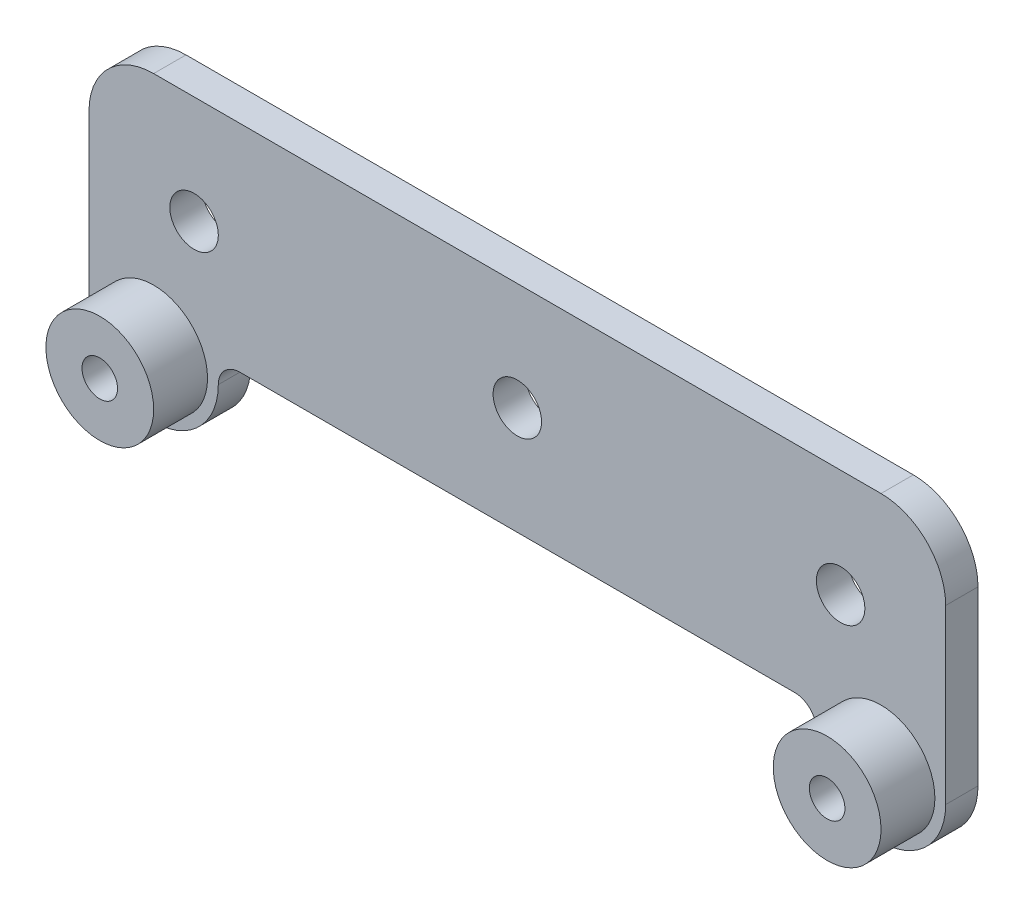
ISO-10303-21;
HEADER;
FILE_DESCRIPTION(('STEP AP214'),'2;1');
FILE_NAME('part.step','',(''),(''),'','','');
FILE_SCHEMA(('AUTOMOTIVE_DESIGN { 1 0 10303 214 1 1 1 1 }'));
ENDSEC;
DATA;
#1=APPLICATION_CONTEXT('core data for automotive mechanical design processes');
#2=APPLICATION_PROTOCOL_DEFINITION('international standard','automotive_design',2000,#1);
#3=PRODUCT_CONTEXT('',#1,'mechanical');
#4=PRODUCT('Part','Part','',(#3));
#5=PRODUCT_RELATED_PRODUCT_CATEGORY('part','',(#4));
#6=PRODUCT_DEFINITION_FORMATION('','',#4);
#7=PRODUCT_DEFINITION_CONTEXT('part definition',#1,'design');
#8=PRODUCT_DEFINITION('design','',#6,#7);
#9=PRODUCT_DEFINITION_SHAPE('','',#8);
#10=(LENGTH_UNIT() NAMED_UNIT(*) SI_UNIT(.MILLI.,.METRE.));
#11=(NAMED_UNIT(*) PLANE_ANGLE_UNIT() SI_UNIT($,.RADIAN.));
#12=(NAMED_UNIT(*) SI_UNIT($,.STERADIAN.) SOLID_ANGLE_UNIT());
#13=UNCERTAINTY_MEASURE_WITH_UNIT(LENGTH_MEASURE(1.E-05),#10,'distance_accuracy_value','');
#14=(GEOMETRIC_REPRESENTATION_CONTEXT(3) GLOBAL_UNCERTAINTY_ASSIGNED_CONTEXT((#13)) GLOBAL_UNIT_ASSIGNED_CONTEXT((#10,
#11,#12)) REPRESENTATION_CONTEXT('',''));
#15=CARTESIAN_POINT('',(0.,0.,0.));
#16=DIRECTION('',(0.,0.,1.));
#17=DIRECTION('',(1.,0.,0.));
#18=AXIS2_PLACEMENT_3D('',#15,#16,#17);
#19=CARTESIAN_POINT('',(-25.75,-12.,3.));
#20=DIRECTION('',(0.,0.,-1.));
#21=DIRECTION('',(-1.,0.,0.));
#22=AXIS2_PLACEMENT_3D('',#19,#20,#21);
#23=CYLINDRICAL_SURFACE('',#22,1.99999999999997);
#24=CARTESIAN_POINT('',(-25.75,-12.,0.));
#25=DIRECTION('',(0.,0.,-1.));
#26=DIRECTION('',(1.,0.,0.));
#27=AXIS2_PLACEMENT_3D('',#24,#25,#26);
#28=CIRCLE('',#27,1.99999999999997);
#29=CARTESIAN_POINT('',(-27.75,-12.,0.));
#30=VERTEX_POINT('',#29);
#31=CARTESIAN_POINT('',(-25.75,-10.,0.));
#32=VERTEX_POINT('',#31);
#33=EDGE_CURVE('E140',#30,#32,#28,.T.);
#34=ORIENTED_EDGE('',*,*,#33,.T.);
#35=DIRECTION('',(0.,0.,-1.));
#36=VECTOR('',#35,1.);
#37=CARTESIAN_POINT('',(-25.75,-10.,3.));
#38=LINE('',#37,#36);
#39=CARTESIAN_POINT('',(-25.75,-10.,3.));
#40=VERTEX_POINT('',#39);
#41=EDGE_CURVE('E11',#40,#32,#38,.T.);
#42=ORIENTED_EDGE('',*,*,#41,.F.);
#43=CARTESIAN_POINT('',(-25.75,-12.,3.));
#44=DIRECTION('',(0.,0.,-1.));
#45=DIRECTION('',(1.,0.,0.));
#46=AXIS2_PLACEMENT_3D('',#43,#44,#45);
#47=CIRCLE('',#46,1.99999999999997);
#48=CARTESIAN_POINT('',(-27.75,-12.,3.));
#49=VERTEX_POINT('',#48);
#50=EDGE_CURVE('E159',#49,#40,#47,.T.);
#51=ORIENTED_EDGE('',*,*,#50,.F.);
#52=DIRECTION('',(0.,0.,-1.));
#53=VECTOR('',#52,1.);
#54=CARTESIAN_POINT('',(-27.75,-12.,3.));
#55=LINE('',#54,#53);
#56=EDGE_CURVE('E136',#49,#30,#55,.T.);
#57=ORIENTED_EDGE('',*,*,#56,.T.);
#58=EDGE_LOOP('',(#34,#42,#51,#57));
#59=FACE_BOUND('',#58,.T.);
#60=ADVANCED_FACE('F32',(#59),#23,.F.);
#61=CARTESIAN_POINT('',(25.75,-10.,3.));
#62=DIRECTION('',(0.,1.,0.));
#63=DIRECTION('',(0.,0.,1.));
#64=AXIS2_PLACEMENT_3D('',#61,#62,#63);
#65=PLANE('',#64);
#66=DIRECTION('',(1.,0.,0.));
#67=VECTOR('',#66,1.);
#68=CARTESIAN_POINT('',(25.75,-10.,0.));
#69=LINE('',#68,#67);
#70=CARTESIAN_POINT('',(25.75,-10.,0.));
#71=VERTEX_POINT('',#70);
#72=EDGE_CURVE('E143',#32,#71,#69,.T.);
#73=ORIENTED_EDGE('',*,*,#72,.T.);
#74=DIRECTION('',(0.,0.,-1.));
#75=VECTOR('',#74,1.);
#76=CARTESIAN_POINT('',(25.75,-10.,3.));
#77=LINE('',#76,#75);
#78=CARTESIAN_POINT('',(25.75,-10.,3.));
#79=VERTEX_POINT('',#78);
#80=EDGE_CURVE('E40',#79,#71,#77,.T.);
#81=ORIENTED_EDGE('',*,*,#80,.F.);
#82=DIRECTION('',(1.,0.,0.));
#83=VECTOR('',#82,1.);
#84=CARTESIAN_POINT('',(25.75,-10.,3.));
#85=LINE('',#84,#83);
#86=EDGE_CURVE('E97',#40,#79,#85,.T.);
#87=ORIENTED_EDGE('',*,*,#86,.F.);
#88=ORIENTED_EDGE('',*,*,#41,.T.);
#89=EDGE_LOOP('',(#73,#81,#87,#88));
#90=FACE_BOUND('',#89,.T.);
#91=ADVANCED_FACE('F278',(#90),#65,.F.);
#92=CARTESIAN_POINT('',(25.75,-12.,3.));
#93=DIRECTION('',(0.,0.,-1.));
#94=DIRECTION('',(-1.,0.,0.));
#95=AXIS2_PLACEMENT_3D('',#92,#93,#94);
#96=CYLINDRICAL_SURFACE('',#95,1.99999999999999);
#97=CARTESIAN_POINT('',(25.75,-12.,0.));
#98=DIRECTION('',(0.,0.,-1.));
#99=DIRECTION('',(1.,0.,0.));
#100=AXIS2_PLACEMENT_3D('',#97,#98,#99);
#101=CIRCLE('',#100,1.99999999999999);
#102=CARTESIAN_POINT('',(27.75,-12.,0.));
#103=VERTEX_POINT('',#102);
#104=EDGE_CURVE('E146',#71,#103,#101,.T.);
#105=ORIENTED_EDGE('',*,*,#104,.T.);
#106=DIRECTION('',(0.,0.,-1.));
#107=VECTOR('',#106,1.);
#108=CARTESIAN_POINT('',(27.75,-12.,3.));
#109=LINE('',#108,#107);
#110=CARTESIAN_POINT('',(27.75,-12.,3.));
#111=VERTEX_POINT('',#110);
#112=EDGE_CURVE('E172',#111,#103,#109,.T.);
#113=ORIENTED_EDGE('',*,*,#112,.F.);
#114=CARTESIAN_POINT('',(25.75,-12.,3.));
#115=DIRECTION('',(0.,0.,-1.));
#116=DIRECTION('',(1.,0.,0.));
#117=AXIS2_PLACEMENT_3D('',#114,#115,#116);
#118=CIRCLE('',#117,1.99999999999999);
#119=EDGE_CURVE('E180',#79,#111,#118,.T.);
#120=ORIENTED_EDGE('',*,*,#119,.F.);
#121=ORIENTED_EDGE('',*,*,#80,.T.);
#122=EDGE_LOOP('',(#105,#113,#120,#121));
#123=FACE_BOUND('',#122,.T.);
#124=ADVANCED_FACE('F178',(#123),#96,.F.);
#125=CARTESIAN_POINT('',(33.75,-12.,3.));
#126=DIRECTION('',(0.,0.,-1.));
#127=DIRECTION('',(-1.,0.,0.));
#128=AXIS2_PLACEMENT_3D('',#125,#126,#127);
#129=CYLINDRICAL_SURFACE('',#128,5.99999999999999);
#130=CARTESIAN_POINT('',(33.75,-12.,0.));
#131=DIRECTION('',(0.,0.,1.));
#132=DIRECTION('',(1.,0.,0.));
#133=AXIS2_PLACEMENT_3D('',#130,#131,#132);
#134=CIRCLE('',#133,5.99999999999999);
#135=CARTESIAN_POINT('',(39.75,-12.,0.));
#136=VERTEX_POINT('',#135);
#137=EDGE_CURVE('E148',#103,#136,#134,.T.);
#138=ORIENTED_EDGE('',*,*,#137,.T.);
#139=DIRECTION('',(0.,0.,-1.));
#140=VECTOR('',#139,1.);
#141=CARTESIAN_POINT('',(39.75,-12.,3.));
#142=LINE('',#141,#140);
#143=CARTESIAN_POINT('',(39.75,-12.,3.));
#144=VERTEX_POINT('',#143);
#145=EDGE_CURVE('E169',#144,#136,#142,.T.);
#146=ORIENTED_EDGE('',*,*,#145,.F.);
#147=CARTESIAN_POINT('',(33.75,-12.,3.));
#148=DIRECTION('',(0.,0.,1.));
#149=DIRECTION('',(1.,0.,0.));
#150=AXIS2_PLACEMENT_3D('',#147,#148,#149);
#151=CIRCLE('',#150,5.99999999999999);
#152=EDGE_CURVE('E198',#111,#144,#151,.T.);
#153=ORIENTED_EDGE('',*,*,#152,.F.);
#154=ORIENTED_EDGE('',*,*,#112,.T.);
#155=EDGE_LOOP('',(#138,#146,#153,#154));
#156=FACE_BOUND('',#155,.T.);
#157=ADVANCED_FACE('F189',(#156),#129,.T.);
#158=CARTESIAN_POINT('',(39.75,4.,3.));
#159=DIRECTION('',(-1.,0.,0.));
#160=DIRECTION('',(0.,-1.,0.));
#161=AXIS2_PLACEMENT_3D('',#158,#159,#160);
#162=PLANE('',#161);
#163=DIRECTION('',(0.,1.,0.));
#164=VECTOR('',#163,1.);
#165=CARTESIAN_POINT('',(39.75,4.,0.));
#166=LINE('',#165,#164);
#167=CARTESIAN_POINT('',(39.75,4.,0.));
#168=VERTEX_POINT('',#167);
#169=EDGE_CURVE('E150',#136,#168,#166,.T.);
#170=ORIENTED_EDGE('',*,*,#169,.T.);
#171=DIRECTION('',(0.,0.,-1.));
#172=VECTOR('',#171,1.);
#173=CARTESIAN_POINT('',(39.75,4.,3.));
#174=LINE('',#173,#172);
#175=CARTESIAN_POINT('',(39.75,4.,3.));
#176=VERTEX_POINT('',#175);
#177=EDGE_CURVE('E166',#176,#168,#174,.T.);
#178=ORIENTED_EDGE('',*,*,#177,.F.);
#179=DIRECTION('',(0.,1.,0.));
#180=VECTOR('',#179,1.);
#181=CARTESIAN_POINT('',(39.75,4.,3.));
#182=LINE('',#181,#180);
#183=EDGE_CURVE('E195',#144,#176,#182,.T.);
#184=ORIENTED_EDGE('',*,*,#183,.F.);
#185=ORIENTED_EDGE('',*,*,#145,.T.);
#186=EDGE_LOOP('',(#170,#178,#184,#185));
#187=FACE_BOUND('',#186,.T.);
#188=ADVANCED_FACE('F193',(#187),#162,.F.);
#189=CARTESIAN_POINT('',(33.75,4.,3.));
#190=DIRECTION('',(0.,0.,-1.));
#191=DIRECTION('',(-1.,0.,0.));
#192=AXIS2_PLACEMENT_3D('',#189,#190,#191);
#193=CYLINDRICAL_SURFACE('',#192,6.);
#194=CARTESIAN_POINT('',(33.75,4.,0.));
#195=DIRECTION('',(0.,0.,1.));
#196=DIRECTION('',(-1.,0.,0.));
#197=AXIS2_PLACEMENT_3D('',#194,#195,#196);
#198=CIRCLE('',#197,6.);
#199=CARTESIAN_POINT('',(33.75,10.,0.));
#200=VERTEX_POINT('',#199);
#201=EDGE_CURVE('E152',#168,#200,#198,.T.);
#202=ORIENTED_EDGE('',*,*,#201,.T.);
#203=DIRECTION('',(0.,0.,-1.));
#204=VECTOR('',#203,1.);
#205=CARTESIAN_POINT('',(33.75,10.,3.));
#206=LINE('',#205,#204);
#207=CARTESIAN_POINT('',(33.75,10.,3.));
#208=VERTEX_POINT('',#207);
#209=EDGE_CURVE('E163',#208,#200,#206,.T.);
#210=ORIENTED_EDGE('',*,*,#209,.F.);
#211=CARTESIAN_POINT('',(33.75,4.,3.));
#212=DIRECTION('',(0.,0.,1.));
#213=DIRECTION('',(-1.,0.,0.));
#214=AXIS2_PLACEMENT_3D('',#211,#212,#213);
#215=CIRCLE('',#214,6.);
#216=EDGE_CURVE('E197',#176,#208,#215,.T.);
#217=ORIENTED_EDGE('',*,*,#216,.F.);
#218=ORIENTED_EDGE('',*,*,#177,.T.);
#219=EDGE_LOOP('',(#202,#210,#217,#218));
#220=FACE_BOUND('',#219,.T.);
#221=ADVANCED_FACE('F290',(#220),#193,.T.);
#222=CARTESIAN_POINT('',(-33.75,10.,3.));
#223=DIRECTION('',(0.,-1.,0.));
#224=DIRECTION('',(0.,0.,-1.));
#225=AXIS2_PLACEMENT_3D('',#222,#223,#224);
#226=PLANE('',#225);
#227=DIRECTION('',(-1.,0.,0.));
#228=VECTOR('',#227,1.);
#229=CARTESIAN_POINT('',(-33.75,10.,0.));
#230=LINE('',#229,#228);
#231=CARTESIAN_POINT('',(-33.75,10.,0.));
#232=VERTEX_POINT('',#231);
#233=EDGE_CURVE('E154',#200,#232,#230,.T.);
#234=ORIENTED_EDGE('',*,*,#233,.T.);
#235=DIRECTION('',(0.,0.,-1.));
#236=VECTOR('',#235,1.);
#237=CARTESIAN_POINT('',(-33.75,10.,3.));
#238=LINE('',#237,#236);
#239=CARTESIAN_POINT('',(-33.75,10.,3.));
#240=VERTEX_POINT('',#239);
#241=EDGE_CURVE('E131',#240,#232,#238,.T.);
#242=ORIENTED_EDGE('',*,*,#241,.F.);
#243=DIRECTION('',(-1.,0.,0.));
#244=VECTOR('',#243,1.);
#245=CARTESIAN_POINT('',(-33.75,10.,3.));
#246=LINE('',#245,#244);
#247=EDGE_CURVE('E122',#208,#240,#246,.T.);
#248=ORIENTED_EDGE('',*,*,#247,.F.);
#249=ORIENTED_EDGE('',*,*,#209,.T.);
#250=EDGE_LOOP('',(#234,#242,#248,#249));
#251=FACE_BOUND('',#250,.T.);
#252=ADVANCED_FACE('F287',(#251),#226,.F.);
#253=CARTESIAN_POINT('',(-33.75,4.,3.));
#254=DIRECTION('',(0.,0.,-1.));
#255=DIRECTION('',(-1.,0.,0.));
#256=AXIS2_PLACEMENT_3D('',#253,#254,#255);
#257=CYLINDRICAL_SURFACE('',#256,6.);
#258=CARTESIAN_POINT('',(-33.75,4.,0.));
#259=DIRECTION('',(0.,0.,1.));
#260=DIRECTION('',(1.,0.,0.));
#261=AXIS2_PLACEMENT_3D('',#258,#259,#260);
#262=CIRCLE('',#261,6.);
#263=CARTESIAN_POINT('',(-39.75,4.,0.));
#264=VERTEX_POINT('',#263);
#265=EDGE_CURVE('E130',#232,#264,#262,.T.);
#266=ORIENTED_EDGE('',*,*,#265,.T.);
#267=DIRECTION('',(0.,0.,-1.));
#268=VECTOR('',#267,1.);
#269=CARTESIAN_POINT('',(-39.75,4.,3.));
#270=LINE('',#269,#268);
#271=CARTESIAN_POINT('',(-39.75,4.,3.));
#272=VERTEX_POINT('',#271);
#273=EDGE_CURVE('E127',#272,#264,#270,.T.);
#274=ORIENTED_EDGE('',*,*,#273,.F.);
#275=CARTESIAN_POINT('',(-33.75,4.,3.));
#276=DIRECTION('',(0.,0.,1.));
#277=DIRECTION('',(1.,0.,0.));
#278=AXIS2_PLACEMENT_3D('',#275,#276,#277);
#279=CIRCLE('',#278,6.);
#280=EDGE_CURVE('E116',#240,#272,#279,.T.);
#281=ORIENTED_EDGE('',*,*,#280,.F.);
#282=ORIENTED_EDGE('',*,*,#241,.T.);
#283=EDGE_LOOP('',(#266,#274,#281,#282));
#284=FACE_BOUND('',#283,.T.);
#285=ADVANCED_FACE('F128',(#284),#257,.T.);
#286=CARTESIAN_POINT('',(-39.75,-12.,3.));
#287=DIRECTION('',(1.,0.,0.));
#288=DIRECTION('',(0.,0.,-1.));
#289=AXIS2_PLACEMENT_3D('',#286,#287,#288);
#290=PLANE('',#289);
#291=DIRECTION('',(0.,-1.,0.));
#292=VECTOR('',#291,1.);
#293=CARTESIAN_POINT('',(-39.75,-12.,0.));
#294=LINE('',#293,#292);
#295=CARTESIAN_POINT('',(-39.75,-12.,0.));
#296=VERTEX_POINT('',#295);
#297=EDGE_CURVE('E83',#264,#296,#294,.T.);
#298=ORIENTED_EDGE('',*,*,#297,.T.);
#299=DIRECTION('',(0.,0.,-1.));
#300=VECTOR('',#299,1.);
#301=CARTESIAN_POINT('',(-39.75,-12.,3.));
#302=LINE('',#301,#300);
#303=CARTESIAN_POINT('',(-39.75,-12.,3.));
#304=VERTEX_POINT('',#303);
#305=EDGE_CURVE('E132',#304,#296,#302,.T.);
#306=ORIENTED_EDGE('',*,*,#305,.F.);
#307=DIRECTION('',(0.,-1.,0.));
#308=VECTOR('',#307,1.);
#309=CARTESIAN_POINT('',(-39.75,-12.,3.));
#310=LINE('',#309,#308);
#311=EDGE_CURVE('E120',#272,#304,#310,.T.);
#312=ORIENTED_EDGE('',*,*,#311,.F.);
#313=ORIENTED_EDGE('',*,*,#273,.T.);
#314=EDGE_LOOP('',(#298,#306,#312,#313));
#315=FACE_BOUND('',#314,.T.);
#316=ADVANCED_FACE('F134',(#315),#290,.F.);
#317=CARTESIAN_POINT('',(-33.75,-12.,3.));
#318=DIRECTION('',(0.,0.,-1.));
#319=DIRECTION('',(-1.,0.,0.));
#320=AXIS2_PLACEMENT_3D('',#317,#318,#319);
#321=CYLINDRICAL_SURFACE('',#320,6.);
#322=CARTESIAN_POINT('',(-33.75,-12.,0.));
#323=DIRECTION('',(0.,0.,1.));
#324=DIRECTION('',(1.,0.,0.));
#325=AXIS2_PLACEMENT_3D('',#322,#323,#324);
#326=CIRCLE('',#325,6.);
#327=EDGE_CURVE('E89',#296,#30,#326,.T.);
#328=ORIENTED_EDGE('',*,*,#327,.T.);
#329=ORIENTED_EDGE('',*,*,#56,.F.);
#330=CARTESIAN_POINT('',(-33.75,-12.,3.));
#331=DIRECTION('',(0.,0.,1.));
#332=DIRECTION('',(1.,0.,0.));
#333=AXIS2_PLACEMENT_3D('',#330,#331,#332);
#334=CIRCLE('',#333,6.);
#335=EDGE_CURVE('E48',#304,#49,#334,.T.);
#336=ORIENTED_EDGE('',*,*,#335,.F.);
#337=ORIENTED_EDGE('',*,*,#305,.T.);
#338=EDGE_LOOP('',(#328,#329,#336,#337));
#339=FACE_BOUND('',#338,.T.);
#340=ADVANCED_FACE('F252',(#339),#321,.T.);
#341=CARTESIAN_POINT('',(-25.75,-12.,3.));
#342=DIRECTION('',(0.,0.,1.));
#343=DIRECTION('',(1.,0.,0.));
#344=AXIS2_PLACEMENT_3D('',#341,#342,#343);
#345=PLANE('',#344);
#346=CARTESIAN_POINT('',(-30.,0.,3.));
#347=DIRECTION('',(0.,0.,1.));
#348=DIRECTION('',(1.,0.,0.));
#349=AXIS2_PLACEMENT_3D('',#346,#347,#348);
#350=CIRCLE('',#349,2.24999999999999);
#351=CARTESIAN_POINT('',(-27.75,0.,3.));
#352=VERTEX_POINT('',#351);
#353=EDGE_CURVE('E244',#352,#352,#350,.T.);
#354=ORIENTED_EDGE('',*,*,#353,.F.);
#355=EDGE_LOOP('',(#354));
#356=FACE_BOUND('',#355,.T.);
#357=CARTESIAN_POINT('',(30.,0.,3.));
#358=DIRECTION('',(0.,0.,1.));
#359=DIRECTION('',(1.,0.,0.));
#360=AXIS2_PLACEMENT_3D('',#357,#358,#359);
#361=CIRCLE('',#360,2.24999999999999);
#362=CARTESIAN_POINT('',(32.25,0.,3.));
#363=VERTEX_POINT('',#362);
#364=EDGE_CURVE('E238',#363,#363,#361,.T.);
#365=ORIENTED_EDGE('',*,*,#364,.F.);
#366=EDGE_LOOP('',(#365));
#367=FACE_BOUND('',#366,.T.);
#368=CARTESIAN_POINT('',(0.,0.,3.));
#369=DIRECTION('',(0.,0.,1.));
#370=DIRECTION('',(1.,0.,0.));
#371=AXIS2_PLACEMENT_3D('',#368,#369,#370);
#372=CIRCLE('',#371,2.24999999999999);
#373=CARTESIAN_POINT('',(2.24999999999999,0.,3.));
#374=VERTEX_POINT('',#373);
#375=EDGE_CURVE('E232',#374,#374,#372,.T.);
#376=ORIENTED_EDGE('',*,*,#375,.F.);
#377=EDGE_LOOP('',(#376));
#378=FACE_BOUND('',#377,.T.);
#379=CARTESIAN_POINT('',(33.75,-12.,3.));
#380=DIRECTION('',(0.,0.,1.));
#381=DIRECTION('',(1.,0.,0.));
#382=AXIS2_PLACEMENT_3D('',#379,#380,#381);
#383=CIRCLE('',#382,5.);
#384=CARTESIAN_POINT('',(38.75,-12.,3.));
#385=VERTEX_POINT('',#384);
#386=EDGE_CURVE('E212',#385,#385,#383,.T.);
#387=ORIENTED_EDGE('',*,*,#386,.F.);
#388=EDGE_LOOP('',(#387));
#389=FACE_BOUND('',#388,.T.);
#390=CARTESIAN_POINT('',(-33.75,-12.,3.));
#391=DIRECTION('',(0.,0.,1.));
#392=DIRECTION('',(1.,0.,0.));
#393=AXIS2_PLACEMENT_3D('',#390,#391,#392);
#394=CIRCLE('',#393,5.);
#395=CARTESIAN_POINT('',(-28.75,-12.,3.));
#396=VERTEX_POINT('',#395);
#397=EDGE_CURVE('E206',#396,#396,#394,.T.);
#398=ORIENTED_EDGE('',*,*,#397,.F.);
#399=EDGE_LOOP('',(#398));
#400=FACE_BOUND('',#399,.T.);
#401=ORIENTED_EDGE('',*,*,#50,.T.);
#402=ORIENTED_EDGE('',*,*,#86,.T.);
#403=ORIENTED_EDGE('',*,*,#119,.T.);
#404=ORIENTED_EDGE('',*,*,#152,.T.);
#405=ORIENTED_EDGE('',*,*,#183,.T.);
#406=ORIENTED_EDGE('',*,*,#216,.T.);
#407=ORIENTED_EDGE('',*,*,#247,.T.);
#408=ORIENTED_EDGE('',*,*,#280,.T.);
#409=ORIENTED_EDGE('',*,*,#311,.T.);
#410=ORIENTED_EDGE('',*,*,#335,.T.);
#411=EDGE_LOOP('',(#401,#402,#403,#404,#405,#406,#407,#408,#409,#410));
#412=FACE_BOUND('',#411,.T.);
#413=ADVANCED_FACE('F118',(#356,#367,#378,#389,#400,#412),#345,.T.);
#414=CARTESIAN_POINT('',(-25.75,-12.,0.));
#415=DIRECTION('',(0.,0.,1.));
#416=DIRECTION('',(1.,0.,0.));
#417=AXIS2_PLACEMENT_3D('',#414,#415,#416);
#418=PLANE('',#417);
#419=CARTESIAN_POINT('',(-30.,0.,0.));
#420=DIRECTION('',(0.,0.,1.));
#421=DIRECTION('',(1.,0.,0.));
#422=AXIS2_PLACEMENT_3D('',#419,#420,#421);
#423=CIRCLE('',#422,2.24999999999999);
#424=CARTESIAN_POINT('',(-27.75,0.,0.));
#425=VERTEX_POINT('',#424);
#426=EDGE_CURVE('E241',#425,#425,#423,.T.);
#427=ORIENTED_EDGE('',*,*,#426,.T.);
#428=EDGE_LOOP('',(#427));
#429=FACE_BOUND('',#428,.T.);
#430=CARTESIAN_POINT('',(30.,0.,0.));
#431=DIRECTION('',(0.,0.,1.));
#432=DIRECTION('',(1.,0.,0.));
#433=AXIS2_PLACEMENT_3D('',#430,#431,#432);
#434=CIRCLE('',#433,2.24999999999999);
#435=CARTESIAN_POINT('',(32.25,0.,0.));
#436=VERTEX_POINT('',#435);
#437=EDGE_CURVE('E235',#436,#436,#434,.T.);
#438=ORIENTED_EDGE('',*,*,#437,.T.);
#439=EDGE_LOOP('',(#438));
#440=FACE_BOUND('',#439,.T.);
#441=CARTESIAN_POINT('',(0.,0.,0.));
#442=DIRECTION('',(0.,0.,1.));
#443=DIRECTION('',(1.,0.,0.));
#444=AXIS2_PLACEMENT_3D('',#441,#442,#443);
#445=CIRCLE('',#444,2.24999999999999);
#446=CARTESIAN_POINT('',(2.24999999999999,0.,0.));
#447=VERTEX_POINT('',#446);
#448=EDGE_CURVE('E229',#447,#447,#445,.T.);
#449=ORIENTED_EDGE('',*,*,#448,.T.);
#450=EDGE_LOOP('',(#449));
#451=FACE_BOUND('',#450,.T.);
#452=CARTESIAN_POINT('',(-33.75,-12.,0.));
#453=DIRECTION('',(0.,0.,1.));
#454=DIRECTION('',(1.,0.,0.));
#455=AXIS2_PLACEMENT_3D('',#452,#453,#454);
#456=CIRCLE('',#455,1.65);
#457=CARTESIAN_POINT('',(-32.1,-12.,0.));
#458=VERTEX_POINT('',#457);
#459=EDGE_CURVE('E223',#458,#458,#456,.T.);
#460=ORIENTED_EDGE('',*,*,#459,.T.);
#461=EDGE_LOOP('',(#460));
#462=FACE_BOUND('',#461,.T.);
#463=CARTESIAN_POINT('',(33.75,-12.,0.));
#464=DIRECTION('',(0.,0.,1.));
#465=DIRECTION('',(1.,0.,0.));
#466=AXIS2_PLACEMENT_3D('',#463,#464,#465);
#467=CIRCLE('',#466,1.65);
#468=CARTESIAN_POINT('',(35.4,-12.,0.));
#469=VERTEX_POINT('',#468);
#470=EDGE_CURVE('E215',#469,#469,#467,.T.);
#471=ORIENTED_EDGE('',*,*,#470,.T.);
#472=EDGE_LOOP('',(#471));
#473=FACE_BOUND('',#472,.T.);
#474=ORIENTED_EDGE('',*,*,#33,.F.);
#475=ORIENTED_EDGE('',*,*,#327,.F.);
#476=ORIENTED_EDGE('',*,*,#297,.F.);
#477=ORIENTED_EDGE('',*,*,#265,.F.);
#478=ORIENTED_EDGE('',*,*,#233,.F.);
#479=ORIENTED_EDGE('',*,*,#201,.F.);
#480=ORIENTED_EDGE('',*,*,#169,.F.);
#481=ORIENTED_EDGE('',*,*,#137,.F.);
#482=ORIENTED_EDGE('',*,*,#104,.F.);
#483=ORIENTED_EDGE('',*,*,#72,.F.);
#484=EDGE_LOOP('',(#474,#475,#476,#477,#478,#479,#480,#481,#482,#483));
#485=FACE_BOUND('',#484,.T.);
#486=ADVANCED_FACE('F184',(#429,#440,#451,#462,#473,#485),#418,.F.);
#487=CARTESIAN_POINT('',(-33.75,-12.,8.));
#488=DIRECTION('',(0.,0.,-1.));
#489=DIRECTION('',(-1.,0.,0.));
#490=AXIS2_PLACEMENT_3D('',#487,#488,#489);
#491=CYLINDRICAL_SURFACE('',#490,5.);
#492=CARTESIAN_POINT('',(-33.75,-12.,8.));
#493=DIRECTION('',(0.,0.,1.));
#494=DIRECTION('',(1.,0.,0.));
#495=AXIS2_PLACEMENT_3D('',#492,#493,#494);
#496=CIRCLE('',#495,5.);
#497=CARTESIAN_POINT('',(-28.75,-12.,8.));
#498=VERTEX_POINT('',#497);
#499=EDGE_CURVE('E144',#498,#498,#496,.T.);
#500=ORIENTED_EDGE('',*,*,#499,.F.);
#501=EDGE_LOOP('',(#500));
#502=FACE_BOUND('',#501,.T.);
#503=ORIENTED_EDGE('',*,*,#397,.T.);
#504=EDGE_LOOP('',(#503));
#505=FACE_BOUND('',#504,.T.);
#506=ADVANCED_FACE('F262',(#502,#505),#491,.T.);
#507=CARTESIAN_POINT('',(-33.75,-12.,8.));
#508=DIRECTION('',(0.,0.,1.));
#509=DIRECTION('',(1.,0.,0.));
#510=AXIS2_PLACEMENT_3D('',#507,#508,#509);
#511=PLANE('',#510);
#512=CARTESIAN_POINT('',(-33.75,-12.,8.));
#513=DIRECTION('',(0.,0.,1.));
#514=DIRECTION('',(1.,0.,0.));
#515=AXIS2_PLACEMENT_3D('',#512,#513,#514);
#516=CIRCLE('',#515,1.64999999999999);
#517=CARTESIAN_POINT('',(-32.1,-12.,8.));
#518=VERTEX_POINT('',#517);
#519=EDGE_CURVE('E226',#518,#518,#516,.T.);
#520=ORIENTED_EDGE('',*,*,#519,.F.);
#521=EDGE_LOOP('',(#520));
#522=FACE_BOUND('',#521,.T.);
#523=ORIENTED_EDGE('',*,*,#499,.T.);
#524=EDGE_LOOP('',(#523));
#525=FACE_BOUND('',#524,.T.);
#526=ADVANCED_FACE('F264',(#522,#525),#511,.T.);
#527=CARTESIAN_POINT('',(33.75,-12.,8.));
#528=DIRECTION('',(0.,0.,-1.));
#529=DIRECTION('',(-1.,0.,0.));
#530=AXIS2_PLACEMENT_3D('',#527,#528,#529);
#531=CYLINDRICAL_SURFACE('',#530,5.);
#532=CARTESIAN_POINT('',(33.75,-12.,8.));
#533=DIRECTION('',(0.,0.,1.));
#534=DIRECTION('',(1.,0.,0.));
#535=AXIS2_PLACEMENT_3D('',#532,#533,#534);
#536=CIRCLE('',#535,5.);
#537=CARTESIAN_POINT('',(38.75,-12.,8.));
#538=VERTEX_POINT('',#537);
#539=EDGE_CURVE('E209',#538,#538,#536,.T.);
#540=ORIENTED_EDGE('',*,*,#539,.F.);
#541=EDGE_LOOP('',(#540));
#542=FACE_BOUND('',#541,.T.);
#543=ORIENTED_EDGE('',*,*,#386,.T.);
#544=EDGE_LOOP('',(#543));
#545=FACE_BOUND('',#544,.T.);
#546=ADVANCED_FACE('F271',(#542,#545),#531,.T.);
#547=CARTESIAN_POINT('',(33.75,-12.,8.));
#548=DIRECTION('',(0.,0.,1.));
#549=DIRECTION('',(1.,0.,0.));
#550=AXIS2_PLACEMENT_3D('',#547,#548,#549);
#551=PLANE('',#550);
#552=CARTESIAN_POINT('',(33.75,-12.,8.));
#553=DIRECTION('',(0.,0.,1.));
#554=DIRECTION('',(1.,0.,0.));
#555=AXIS2_PLACEMENT_3D('',#552,#553,#554);
#556=CIRCLE('',#555,1.64999999999999);
#557=CARTESIAN_POINT('',(35.4,-12.,8.));
#558=VERTEX_POINT('',#557);
#559=EDGE_CURVE('E220',#558,#558,#556,.T.);
#560=ORIENTED_EDGE('',*,*,#559,.F.);
#561=EDGE_LOOP('',(#560));
#562=FACE_BOUND('',#561,.T.);
#563=ORIENTED_EDGE('',*,*,#539,.T.);
#564=EDGE_LOOP('',(#563));
#565=FACE_BOUND('',#564,.T.);
#566=ADVANCED_FACE('F365',(#562,#565),#551,.T.);
#567=CARTESIAN_POINT('',(33.75,-12.,8.));
#568=DIRECTION('',(0.,0.,1.));
#569=DIRECTION('',(1.,0.,0.));
#570=AXIS2_PLACEMENT_3D('',#567,#568,#569);
#571=CYLINDRICAL_SURFACE('',#570,1.65);
#572=ORIENTED_EDGE('',*,*,#470,.F.);
#573=EDGE_LOOP('',(#572));
#574=FACE_BOUND('',#573,.T.);
#575=ORIENTED_EDGE('',*,*,#559,.T.);
#576=EDGE_LOOP('',(#575));
#577=FACE_BOUND('',#576,.T.);
#578=ADVANCED_FACE('F380',(#574,#577),#571,.F.);
#579=CARTESIAN_POINT('',(-33.75,-12.,8.));
#580=DIRECTION('',(0.,0.,1.));
#581=DIRECTION('',(1.,0.,0.));
#582=AXIS2_PLACEMENT_3D('',#579,#580,#581);
#583=CYLINDRICAL_SURFACE('',#582,1.65);
#584=ORIENTED_EDGE('',*,*,#459,.F.);
#585=EDGE_LOOP('',(#584));
#586=FACE_BOUND('',#585,.T.);
#587=ORIENTED_EDGE('',*,*,#519,.T.);
#588=EDGE_LOOP('',(#587));
#589=FACE_BOUND('',#588,.T.);
#590=ADVANCED_FACE('F390',(#586,#589),#583,.F.);
#591=CARTESIAN_POINT('',(0.,0.,3.));
#592=DIRECTION('',(0.,0.,1.));
#593=DIRECTION('',(1.,0.,0.));
#594=AXIS2_PLACEMENT_3D('',#591,#592,#593);
#595=CYLINDRICAL_SURFACE('',#594,2.24999999999999);
#596=ORIENTED_EDGE('',*,*,#448,.F.);
#597=EDGE_LOOP('',(#596));
#598=FACE_BOUND('',#597,.T.);
#599=ORIENTED_EDGE('',*,*,#375,.T.);
#600=EDGE_LOOP('',(#599));
#601=FACE_BOUND('',#600,.T.);
#602=ADVANCED_FACE('F400',(#598,#601),#595,.F.);
#603=CARTESIAN_POINT('',(30.,0.,3.));
#604=DIRECTION('',(0.,0.,1.));
#605=DIRECTION('',(1.,0.,0.));
#606=AXIS2_PLACEMENT_3D('',#603,#604,#605);
#607=CYLINDRICAL_SURFACE('',#606,2.24999999999999);
#608=ORIENTED_EDGE('',*,*,#437,.F.);
#609=EDGE_LOOP('',(#608));
#610=FACE_BOUND('',#609,.T.);
#611=ORIENTED_EDGE('',*,*,#364,.T.);
#612=EDGE_LOOP('',(#611));
#613=FACE_BOUND('',#612,.T.);
#614=ADVANCED_FACE('F420',(#610,#613),#607,.F.);
#615=CARTESIAN_POINT('',(-30.,0.,3.));
#616=DIRECTION('',(0.,0.,1.));
#617=DIRECTION('',(1.,0.,0.));
#618=AXIS2_PLACEMENT_3D('',#615,#616,#617);
#619=CYLINDRICAL_SURFACE('',#618,2.24999999999999);
#620=ORIENTED_EDGE('',*,*,#426,.F.);
#621=EDGE_LOOP('',(#620));
#622=FACE_BOUND('',#621,.T.);
#623=ORIENTED_EDGE('',*,*,#353,.T.);
#624=EDGE_LOOP('',(#623));
#625=FACE_BOUND('',#624,.T.);
#626=ADVANCED_FACE('F248',(#622,#625),#619,.F.);
#627=CLOSED_SHELL('',(#60,#91,#124,#157,#188,#221,#252,#285,#316,#340,#413,#486,#506,#526,#546,
#566,#578,#590,#602,#614,#626));
#628=MANIFOLD_SOLID_BREP('B2',#627);
#629=ADVANCED_BREP_SHAPE_REPRESENTATION('',(#18,#628),#14);
#630=SHAPE_DEFINITION_REPRESENTATION(#9,#629);
ENDSEC;
END-ISO-10303-21;
